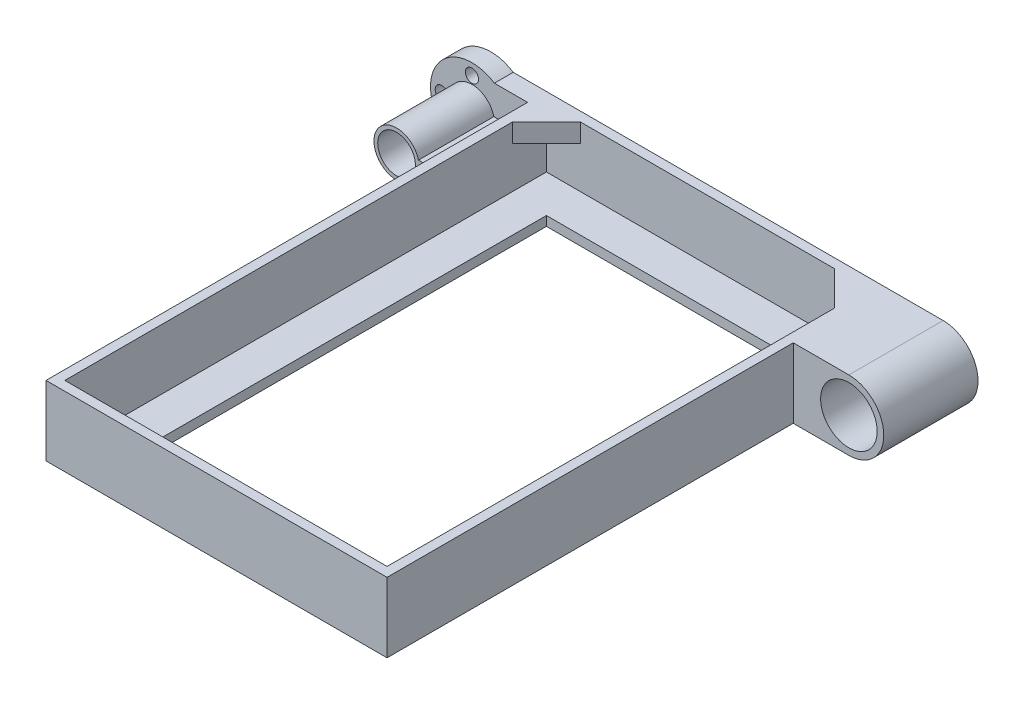
ISO-10303-21;
HEADER;
FILE_DESCRIPTION(('STEP AP214'),'2;1');
FILE_NAME('part.step','',(''),(''),'','','');
FILE_SCHEMA(('AUTOMOTIVE_DESIGN { 1 0 10303 214 1 1 1 1 }'));
ENDSEC;
DATA;
#1=APPLICATION_CONTEXT('core data for automotive mechanical design processes');
#2=APPLICATION_PROTOCOL_DEFINITION('international standard','automotive_design',2000,#1);
#3=PRODUCT_CONTEXT('',#1,'mechanical');
#4=PRODUCT('Part','Part','',(#3));
#5=PRODUCT_RELATED_PRODUCT_CATEGORY('part','',(#4));
#6=PRODUCT_DEFINITION_FORMATION('','',#4);
#7=PRODUCT_DEFINITION_CONTEXT('part definition',#1,'design');
#8=PRODUCT_DEFINITION('design','',#6,#7);
#9=PRODUCT_DEFINITION_SHAPE('','',#8);
#10=(LENGTH_UNIT() NAMED_UNIT(*) SI_UNIT(.MILLI.,.METRE.));
#11=(NAMED_UNIT(*) PLANE_ANGLE_UNIT() SI_UNIT($,.RADIAN.));
#12=(NAMED_UNIT(*) SI_UNIT($,.STERADIAN.) SOLID_ANGLE_UNIT());
#13=UNCERTAINTY_MEASURE_WITH_UNIT(LENGTH_MEASURE(1.E-05),#10,'distance_accuracy_value','');
#14=(GEOMETRIC_REPRESENTATION_CONTEXT(3) GLOBAL_UNCERTAINTY_ASSIGNED_CONTEXT((#13)) GLOBAL_UNIT_ASSIGNED_CONTEXT((#10,
#11,#12)) REPRESENTATION_CONTEXT('',''));
#15=CARTESIAN_POINT('',(0.,0.,0.));
#16=DIRECTION('',(0.,0.,1.));
#17=DIRECTION('',(1.,0.,0.));
#18=AXIS2_PLACEMENT_3D('',#15,#16,#17);
#19=CARTESIAN_POINT('',(45.24,16.,66.38));
#20=DIRECTION('',(-1.,0.,0.));
#21=DIRECTION('',(0.,0.,1.));
#22=AXIS2_PLACEMENT_3D('',#19,#20,#21);
#23=PLANE('',#22);
#24=DIRECTION('',(0.,-1.,0.));
#25=VECTOR('',#24,1.);
#26=CARTESIAN_POINT('',(45.24,0.,-41.38));
#27=LINE('',#26,#25);
#28=CARTESIAN_POINT('',(45.24,16.,-41.38));
#29=VERTEX_POINT('',#28);
#30=CARTESIAN_POINT('',(45.24,-2.5,-41.38));
#31=VERTEX_POINT('',#30);
#32=EDGE_CURVE('E400',#29,#31,#27,.T.);
#33=ORIENTED_EDGE('',*,*,#32,.F.);
#34=DIRECTION('',(0.,0.,-1.));
#35=VECTOR('',#34,1.);
#36=CARTESIAN_POINT('',(45.24,16.,66.38));
#37=LINE('',#36,#35);
#38=CARTESIAN_POINT('',(45.24,16.,66.38));
#39=VERTEX_POINT('',#38);
#40=EDGE_CURVE('E475',#39,#29,#37,.T.);
#41=ORIENTED_EDGE('',*,*,#40,.F.);
#42=DIRECTION('',(0.,-1.,0.));
#43=VECTOR('',#42,1.);
#44=CARTESIAN_POINT('',(45.24,16.,66.38));
#45=LINE('',#44,#43);
#46=CARTESIAN_POINT('',(45.24,-2.5,66.38));
#47=VERTEX_POINT('',#46);
#48=EDGE_CURVE('E488',#39,#47,#45,.T.);
#49=ORIENTED_EDGE('',*,*,#48,.T.);
#50=DIRECTION('',(0.,0.,1.));
#51=VECTOR('',#50,1.);
#52=CARTESIAN_POINT('',(45.24,-2.5,66.38));
#53=LINE('',#52,#51);
#54=EDGE_CURVE('E415',#31,#47,#53,.T.);
#55=ORIENTED_EDGE('',*,*,#54,.F.);
#56=EDGE_LOOP('',(#33,#41,#49,#55));
#57=FACE_BOUND('',#56,.T.);
#58=ADVANCED_FACE('F42',(#57),#23,.F.);
#59=CARTESIAN_POINT('',(0.,16.,0.));
#60=DIRECTION('',(0.,1.,0.));
#61=DIRECTION('',(0.,0.,1.));
#62=AXIS2_PLACEMENT_3D('',#59,#60,#61);
#63=PLANE('',#62);
#64=DIRECTION('',(-1.,0.,0.));
#65=VECTOR('',#64,1.);
#66=CARTESIAN_POINT('',(-45.24,16.,-61.38));
#67=LINE('',#66,#65);
#68=CARTESIAN_POINT('',(-45.24,16.,-61.38));
#69=VERTEX_POINT('',#68);
#70=CARTESIAN_POINT('',(-54.0470595501047,16.,-61.38));
#71=VERTEX_POINT('',#70);
#72=EDGE_CURVE('E334',#69,#71,#67,.T.);
#73=ORIENTED_EDGE('',*,*,#72,.F.);
#74=DIRECTION('',(0.,0.,1.));
#75=VECTOR('',#74,1.);
#76=CARTESIAN_POINT('',(-45.24,16.,66.38));
#77=LINE('',#76,#75);
#78=CARTESIAN_POINT('',(-45.24,16.,66.38));
#79=VERTEX_POINT('',#78);
#80=EDGE_CURVE('E482',#69,#79,#77,.T.);
#81=ORIENTED_EDGE('',*,*,#80,.T.);
#82=DIRECTION('',(1.,0.,0.));
#83=VECTOR('',#82,1.);
#84=CARTESIAN_POINT('',(-45.24,16.,66.38));
#85=LINE('',#84,#83);
#86=EDGE_CURVE('E471',#79,#39,#85,.T.);
#87=ORIENTED_EDGE('',*,*,#86,.T.);
#88=ORIENTED_EDGE('',*,*,#40,.T.);
#89=DIRECTION('',(1.,0.,0.));
#90=VECTOR('',#89,1.);
#91=CARTESIAN_POINT('',(0.,16.,-41.38));
#92=LINE('',#91,#90);
#93=CARTESIAN_POINT('',(60.,16.,-41.38));
#94=VERTEX_POINT('',#93);
#95=EDGE_CURVE('E388',#29,#94,#92,.T.);
#96=ORIENTED_EDGE('',*,*,#95,.T.);
#97=DIRECTION('',(0.,0.,-1.));
#98=VECTOR('',#97,1.);
#99=CARTESIAN_POINT('',(60.,16.,-41.38));
#100=LINE('',#99,#98);
#101=CARTESIAN_POINT('',(60.,16.,-66.38));
#102=VERTEX_POINT('',#101);
#103=EDGE_CURVE('E404',#94,#102,#100,.T.);
#104=ORIENTED_EDGE('',*,*,#103,.T.);
#105=DIRECTION('',(-1.,0.,0.));
#106=VECTOR('',#105,1.);
#107=CARTESIAN_POINT('',(-45.24,16.,-66.38));
#108=LINE('',#107,#106);
#109=CARTESIAN_POINT('',(-54.0470595501047,16.,-66.38));
#110=VERTEX_POINT('',#109);
#111=EDGE_CURVE('E479',#102,#110,#108,.T.);
#112=ORIENTED_EDGE('',*,*,#111,.T.);
#113=DIRECTION('',(0.,0.,-1.));
#114=VECTOR('',#113,1.);
#115=CARTESIAN_POINT('',(-54.0470595501047,16.,-61.38));
#116=LINE('',#115,#114);
#117=EDGE_CURVE('E364',#71,#110,#116,.T.);
#118=ORIENTED_EDGE('',*,*,#117,.F.);
#119=EDGE_LOOP('',(#73,#81,#87,#88,#96,#104,#112,#118));
#120=FACE_BOUND('',#119,.T.);
#121=DIRECTION('',(-1.,0.,0.));
#122=VECTOR('',#121,1.);
#123=CARTESIAN_POINT('',(-42.74,16.,-63.88));
#124=LINE('',#123,#122);
#125=CARTESIAN_POINT('',(33.74,16.,-63.88));
#126=VERTEX_POINT('',#125);
#127=CARTESIAN_POINT('',(-33.74,16.,-63.88));
#128=VERTEX_POINT('',#127);
#129=EDGE_CURVE('E435',#126,#128,#124,.T.);
#130=ORIENTED_EDGE('',*,*,#129,.F.);
#131=DIRECTION('',(0.707106781186547,0.,0.707106781186547));
#132=VECTOR('',#131,1.);
#133=CARTESIAN_POINT('',(33.74,16.,-63.88));
#134=LINE('',#133,#132);
#135=CARTESIAN_POINT('',(42.74,16.,-54.88));
#136=VERTEX_POINT('',#135);
#137=EDGE_CURVE('E259',#126,#136,#134,.T.);
#138=ORIENTED_EDGE('',*,*,#137,.T.);
#139=DIRECTION('',(0.,0.,-1.));
#140=VECTOR('',#139,1.);
#141=CARTESIAN_POINT('',(42.74,16.,63.88));
#142=LINE('',#141,#140);
#143=CARTESIAN_POINT('',(42.74,16.,63.88));
#144=VERTEX_POINT('',#143);
#145=EDGE_CURVE('E432',#144,#136,#142,.T.);
#146=ORIENTED_EDGE('',*,*,#145,.F.);
#147=DIRECTION('',(1.,0.,0.));
#148=VECTOR('',#147,1.);
#149=CARTESIAN_POINT('',(-42.74,16.,63.88));
#150=LINE('',#149,#148);
#151=CARTESIAN_POINT('',(-42.74,16.,63.88));
#152=VERTEX_POINT('',#151);
#153=EDGE_CURVE('E442',#152,#144,#150,.T.);
#154=ORIENTED_EDGE('',*,*,#153,.F.);
#155=DIRECTION('',(0.,0.,1.));
#156=VECTOR('',#155,1.);
#157=CARTESIAN_POINT('',(-42.74,16.,63.88));
#158=LINE('',#157,#156);
#159=CARTESIAN_POINT('',(-42.74,16.,-54.88));
#160=VERTEX_POINT('',#159);
#161=EDGE_CURVE('E439',#160,#152,#158,.T.);
#162=ORIENTED_EDGE('',*,*,#161,.F.);
#163=DIRECTION('',(0.707106781186547,0.,-0.707106781186547));
#164=VECTOR('',#163,1.);
#165=CARTESIAN_POINT('',(-42.74,16.,-54.88));
#166=LINE('',#165,#164);
#167=EDGE_CURVE('E235',#160,#128,#166,.T.);
#168=ORIENTED_EDGE('',*,*,#167,.T.);
#169=EDGE_LOOP('',(#130,#138,#146,#154,#162,#168));
#170=FACE_BOUND('',#169,.T.);
#171=ADVANCED_FACE('F517',(#120,#170),#63,.T.);
#172=CARTESIAN_POINT('',(-45.24,16.,66.38));
#173=DIRECTION('',(0.,0.,-1.));
#174=DIRECTION('',(-1.,0.,0.));
#175=AXIS2_PLACEMENT_3D('',#172,#173,#174);
#176=PLANE('',#175);
#177=DIRECTION('',(0.,-1.,0.));
#178=VECTOR('',#177,1.);
#179=CARTESIAN_POINT('',(-45.24,16.,66.38));
#180=LINE('',#179,#178);
#181=CARTESIAN_POINT('',(-45.24,-2.5,66.38));
#182=VERTEX_POINT('',#181);
#183=EDGE_CURVE('E485',#79,#182,#180,.T.);
#184=ORIENTED_EDGE('',*,*,#183,.T.);
#185=DIRECTION('',(-1.,0.,0.));
#186=VECTOR('',#185,1.);
#187=CARTESIAN_POINT('',(-45.24,-2.5,66.38));
#188=LINE('',#187,#186);
#189=EDGE_CURVE('E421',#47,#182,#188,.T.);
#190=ORIENTED_EDGE('',*,*,#189,.F.);
#191=ORIENTED_EDGE('',*,*,#48,.F.);
#192=ORIENTED_EDGE('',*,*,#86,.F.);
#193=EDGE_LOOP('',(#184,#190,#191,#192));
#194=FACE_BOUND('',#193,.T.);
#195=ADVANCED_FACE('F44',(#194),#176,.F.);
#196=CARTESIAN_POINT('',(-45.24,16.,-66.38));
#197=DIRECTION('',(0.,0.,1.));
#198=DIRECTION('',(1.,0.,0.));
#199=AXIS2_PLACEMENT_3D('',#196,#197,#198);
#200=PLANE('',#199);
#201=CARTESIAN_POINT('',(-60.,14.75,-66.38));
#202=DIRECTION('',(0.,0.,-1.));
#203=DIRECTION('',(-1.,0.,0.));
#204=AXIS2_PLACEMENT_3D('',#201,#202,#203);
#205=CIRCLE('',#204,1.75);
#206=CARTESIAN_POINT('',(-61.75,14.75,-66.38));
#207=VERTEX_POINT('',#206);
#208=EDGE_CURVE('E285',#207,#207,#205,.T.);
#209=ORIENTED_EDGE('',*,*,#208,.F.);
#210=EDGE_LOOP('',(#209));
#211=FACE_BOUND('',#210,.T.);
#212=CARTESIAN_POINT('',(-68.,6.75,-66.38));
#213=DIRECTION('',(0.,0.,-1.));
#214=DIRECTION('',(-1.,0.,0.));
#215=AXIS2_PLACEMENT_3D('',#212,#213,#214);
#216=CIRCLE('',#215,1.75);
#217=CARTESIAN_POINT('',(-69.75,6.75,-66.38));
#218=VERTEX_POINT('',#217);
#219=EDGE_CURVE('E295',#218,#218,#216,.T.);
#220=ORIENTED_EDGE('',*,*,#219,.F.);
#221=EDGE_LOOP('',(#220));
#222=FACE_BOUND('',#221,.T.);
#223=CARTESIAN_POINT('',(-60.,-1.25000000000001,-66.38));
#224=DIRECTION('',(0.,0.,-1.));
#225=DIRECTION('',(-1.,0.,0.));
#226=AXIS2_PLACEMENT_3D('',#223,#224,#225);
#227=CIRCLE('',#226,1.75);
#228=CARTESIAN_POINT('',(-61.75,-1.25000000000001,-66.38));
#229=VERTEX_POINT('',#228);
#230=EDGE_CURVE('E281',#229,#229,#227,.T.);
#231=ORIENTED_EDGE('',*,*,#230,.F.);
#232=EDGE_LOOP('',(#231));
#233=FACE_BOUND('',#232,.T.);
#234=DIRECTION('',(1.,0.,0.));
#235=VECTOR('',#234,1.);
#236=CARTESIAN_POINT('',(45.24,-2.5,-66.38));
#237=LINE('',#236,#235);
#238=CARTESIAN_POINT('',(-54.0470595501047,-2.5,-66.38));
#239=VERTEX_POINT('',#238);
#240=CARTESIAN_POINT('',(60.,-2.5,-66.38));
#241=VERTEX_POINT('',#240);
#242=EDGE_CURVE('E428',#239,#241,#237,.T.);
#243=ORIENTED_EDGE('',*,*,#242,.F.);
#244=CARTESIAN_POINT('',(-60.,6.75,-66.38));
#245=DIRECTION('',(0.,0.,-1.));
#246=DIRECTION('',(-1.,0.,0.));
#247=AXIS2_PLACEMENT_3D('',#244,#245,#246);
#248=CIRCLE('',#247,11.);
#249=EDGE_CURVE('E359',#239,#110,#248,.T.);
#250=ORIENTED_EDGE('',*,*,#249,.T.);
#251=ORIENTED_EDGE('',*,*,#111,.F.);
#252=CARTESIAN_POINT('',(60.,6.75,-66.38));
#253=DIRECTION('',(0.,0.,-1.));
#254=DIRECTION('',(-1.,0.,0.));
#255=AXIS2_PLACEMENT_3D('',#252,#253,#254);
#256=CIRCLE('',#255,9.25);
#257=EDGE_CURVE('E389',#102,#241,#256,.T.);
#258=ORIENTED_EDGE('',*,*,#257,.T.);
#259=EDGE_LOOP('',(#243,#250,#251,#258));
#260=FACE_BOUND('',#259,.T.);
#261=CARTESIAN_POINT('',(60.,6.75,-66.38));
#262=DIRECTION('',(0.,0.,-1.));
#263=DIRECTION('',(-1.,0.,0.));
#264=AXIS2_PLACEMENT_3D('',#261,#262,#263);
#265=CIRCLE('',#264,7.5);
#266=CARTESIAN_POINT('',(52.5,6.75,-66.38));
#267=VERTEX_POINT('',#266);
#268=EDGE_CURVE('E383',#267,#267,#265,.T.);
#269=ORIENTED_EDGE('',*,*,#268,.F.);
#270=EDGE_LOOP('',(#269));
#271=FACE_BOUND('',#270,.T.);
#272=CARTESIAN_POINT('',(-60.,6.75,-66.38));
#273=DIRECTION('',(0.,0.,-1.));
#274=DIRECTION('',(-1.,0.,0.));
#275=AXIS2_PLACEMENT_3D('',#272,#273,#274);
#276=CIRCLE('',#275,5.);
#277=CARTESIAN_POINT('',(-65.,6.75,-66.38));
#278=VERTEX_POINT('',#277);
#279=EDGE_CURVE('E371',#278,#278,#276,.T.);
#280=ORIENTED_EDGE('',*,*,#279,.F.);
#281=EDGE_LOOP('',(#280));
#282=FACE_BOUND('',#281,.T.);
#283=ADVANCED_FACE('F526',(#211,#222,#233,#260,#271,#282),#200,.F.);
#284=CARTESIAN_POINT('',(-45.24,16.,66.38));
#285=DIRECTION('',(1.,0.,0.));
#286=DIRECTION('',(0.,0.,-1.));
#287=AXIS2_PLACEMENT_3D('',#284,#285,#286);
#288=PLANE('',#287);
#289=ORIENTED_EDGE('',*,*,#80,.F.);
#290=DIRECTION('',(0.,1.,0.));
#291=VECTOR('',#290,1.);
#292=CARTESIAN_POINT('',(-45.24,8.25,-61.38));
#293=LINE('',#292,#291);
#294=CARTESIAN_POINT('',(-45.24,8.25,-61.38));
#295=VERTEX_POINT('',#294);
#296=EDGE_CURVE('E337',#295,#69,#293,.T.);
#297=ORIENTED_EDGE('',*,*,#296,.F.);
#298=DIRECTION('',(0.,0.,1.));
#299=VECTOR('',#298,1.);
#300=CARTESIAN_POINT('',(-45.24,8.25,-91.6905608658105));
#301=LINE('',#300,#299);
#302=CARTESIAN_POINT('',(-45.24,8.25,-41.38));
#303=VERTEX_POINT('',#302);
#304=EDGE_CURVE('E341',#295,#303,#301,.T.);
#305=ORIENTED_EDGE('',*,*,#304,.T.);
#306=DIRECTION('',(0.,-1.,0.));
#307=VECTOR('',#306,1.);
#308=CARTESIAN_POINT('',(-45.24,0.,-41.38));
#309=LINE('',#308,#307);
#310=CARTESIAN_POINT('',(-45.24,5.25,-41.38));
#311=VERTEX_POINT('',#310);
#312=EDGE_CURVE('E379',#303,#311,#309,.T.);
#313=ORIENTED_EDGE('',*,*,#312,.T.);
#314=DIRECTION('',(0.,0.,1.));
#315=VECTOR('',#314,1.);
#316=CARTESIAN_POINT('',(-45.24,5.25,-91.6905608658105));
#317=LINE('',#316,#315);
#318=CARTESIAN_POINT('',(-45.24,5.25,-61.38));
#319=VERTEX_POINT('',#318);
#320=EDGE_CURVE('E329',#319,#311,#317,.T.);
#321=ORIENTED_EDGE('',*,*,#320,.F.);
#322=DIRECTION('',(0.,1.,0.));
#323=VECTOR('',#322,1.);
#324=CARTESIAN_POINT('',(-45.24,5.25,-61.38));
#325=LINE('',#324,#323);
#326=CARTESIAN_POINT('',(-45.24,-2.5,-61.38));
#327=VERTEX_POINT('',#326);
#328=EDGE_CURVE('E325',#327,#319,#325,.T.);
#329=ORIENTED_EDGE('',*,*,#328,.F.);
#330=DIRECTION('',(0.,0.,-1.));
#331=VECTOR('',#330,1.);
#332=CARTESIAN_POINT('',(-45.24,-2.5,-66.38));
#333=LINE('',#332,#331);
#334=EDGE_CURVE('E425',#182,#327,#333,.T.);
#335=ORIENTED_EDGE('',*,*,#334,.F.);
#336=ORIENTED_EDGE('',*,*,#183,.F.);
#337=EDGE_LOOP('',(#289,#297,#305,#313,#321,#329,#335,#336));
#338=FACE_BOUND('',#337,.T.);
#339=ADVANCED_FACE('F529',(#338),#288,.F.);
#340=CARTESIAN_POINT('',(42.74,16.,63.88));
#341=DIRECTION('',(-1.,0.,0.));
#342=DIRECTION('',(0.,0.,1.));
#343=AXIS2_PLACEMENT_3D('',#340,#341,#342);
#344=PLANE('',#343);
#345=DIRECTION('',(0.,1.,0.));
#346=VECTOR('',#345,1.);
#347=CARTESIAN_POINT('',(42.74,11.,-54.88));
#348=LINE('',#347,#346);
#349=CARTESIAN_POINT('',(42.74,11.,-54.88));
#350=VERTEX_POINT('',#349);
#351=EDGE_CURVE('E277',#350,#136,#348,.T.);
#352=ORIENTED_EDGE('',*,*,#351,.F.);
#353=DIRECTION('',(0.,0.,-1.));
#354=VECTOR('',#353,1.);
#355=CARTESIAN_POINT('',(42.74,11.,-63.88));
#356=LINE('',#355,#354);
#357=CARTESIAN_POINT('',(42.74,11.,-63.88));
#358=VERTEX_POINT('',#357);
#359=EDGE_CURVE('E270',#350,#358,#356,.T.);
#360=ORIENTED_EDGE('',*,*,#359,.T.);
#361=DIRECTION('',(0.,-1.,0.));
#362=VECTOR('',#361,1.);
#363=CARTESIAN_POINT('',(42.74,16.,-63.88));
#364=LINE('',#363,#362);
#365=CARTESIAN_POINT('',(42.74,0.,-63.88));
#366=VERTEX_POINT('',#365);
#367=EDGE_CURVE('E468',#358,#366,#364,.T.);
#368=ORIENTED_EDGE('',*,*,#367,.T.);
#369=DIRECTION('',(0.,0.,-1.));
#370=VECTOR('',#369,1.);
#371=CARTESIAN_POINT('',(42.74,0.,63.88));
#372=LINE('',#371,#370);
#373=CARTESIAN_POINT('',(42.74,0.,63.88));
#374=VERTEX_POINT('',#373);
#375=EDGE_CURVE('E431',#374,#366,#372,.T.);
#376=ORIENTED_EDGE('',*,*,#375,.F.);
#377=DIRECTION('',(0.,-1.,0.));
#378=VECTOR('',#377,1.);
#379=CARTESIAN_POINT('',(42.74,16.,63.88));
#380=LINE('',#379,#378);
#381=EDGE_CURVE('E445',#144,#374,#380,.T.);
#382=ORIENTED_EDGE('',*,*,#381,.F.);
#383=ORIENTED_EDGE('',*,*,#145,.T.);
#384=EDGE_LOOP('',(#352,#360,#368,#376,#382,#383));
#385=FACE_BOUND('',#384,.T.);
#386=ADVANCED_FACE('F532',(#385),#344,.T.);
#387=CARTESIAN_POINT('',(-42.74,16.,-63.88));
#388=DIRECTION('',(0.,0.,1.));
#389=DIRECTION('',(1.,0.,0.));
#390=AXIS2_PLACEMENT_3D('',#387,#388,#389);
#391=PLANE('',#390);
#392=DIRECTION('',(0.,1.,0.));
#393=VECTOR('',#392,1.);
#394=CARTESIAN_POINT('',(-33.74,11.,-63.88));
#395=LINE('',#394,#393);
#396=CARTESIAN_POINT('',(-33.74,11.,-63.88));
#397=VERTEX_POINT('',#396);
#398=EDGE_CURVE('E255',#397,#128,#395,.T.);
#399=ORIENTED_EDGE('',*,*,#398,.F.);
#400=DIRECTION('',(-1.,0.,0.));
#401=VECTOR('',#400,1.);
#402=CARTESIAN_POINT('',(-33.74,11.,-63.88));
#403=LINE('',#402,#401);
#404=CARTESIAN_POINT('',(-42.74,11.,-63.88));
#405=VERTEX_POINT('',#404);
#406=EDGE_CURVE('E248',#397,#405,#403,.T.);
#407=ORIENTED_EDGE('',*,*,#406,.T.);
#408=DIRECTION('',(0.,-1.,0.));
#409=VECTOR('',#408,1.);
#410=CARTESIAN_POINT('',(-42.74,16.,-63.88));
#411=LINE('',#410,#409);
#412=CARTESIAN_POINT('',(-42.74,0.,-63.88));
#413=VERTEX_POINT('',#412);
#414=EDGE_CURVE('E465',#405,#413,#411,.T.);
#415=ORIENTED_EDGE('',*,*,#414,.T.);
#416=DIRECTION('',(-1.,0.,0.));
#417=VECTOR('',#416,1.);
#418=CARTESIAN_POINT('',(-42.74,0.,-63.88));
#419=LINE('',#418,#417);
#420=EDGE_CURVE('E449',#366,#413,#419,.T.);
#421=ORIENTED_EDGE('',*,*,#420,.F.);
#422=ORIENTED_EDGE('',*,*,#367,.F.);
#423=DIRECTION('',(-1.,0.,0.));
#424=VECTOR('',#423,1.);
#425=CARTESIAN_POINT('',(33.74,11.,-63.88));
#426=LINE('',#425,#424);
#427=CARTESIAN_POINT('',(33.74,11.,-63.88));
#428=VERTEX_POINT('',#427);
#429=EDGE_CURVE('E263',#358,#428,#426,.T.);
#430=ORIENTED_EDGE('',*,*,#429,.T.);
#431=DIRECTION('',(0.,1.,0.));
#432=VECTOR('',#431,1.);
#433=CARTESIAN_POINT('',(33.74,11.,-63.88));
#434=LINE('',#433,#432);
#435=EDGE_CURVE('E273',#428,#126,#434,.T.);
#436=ORIENTED_EDGE('',*,*,#435,.T.);
#437=ORIENTED_EDGE('',*,*,#129,.T.);
#438=EDGE_LOOP('',(#399,#407,#415,#421,#422,#430,#436,#437));
#439=FACE_BOUND('',#438,.T.);
#440=ADVANCED_FACE('F537',(#439),#391,.T.);
#441=CARTESIAN_POINT('',(-42.74,16.,63.88));
#442=DIRECTION('',(1.,0.,0.));
#443=DIRECTION('',(0.,0.,-1.));
#444=AXIS2_PLACEMENT_3D('',#441,#442,#443);
#445=PLANE('',#444);
#446=DIRECTION('',(0.,1.,0.));
#447=VECTOR('',#446,1.);
#448=CARTESIAN_POINT('',(-42.74,11.,-54.88));
#449=LINE('',#448,#447);
#450=CARTESIAN_POINT('',(-42.74,11.,-54.88));
#451=VERTEX_POINT('',#450);
#452=EDGE_CURVE('E251',#451,#160,#449,.T.);
#453=ORIENTED_EDGE('',*,*,#452,.T.);
#454=ORIENTED_EDGE('',*,*,#161,.T.);
#455=DIRECTION('',(0.,-1.,0.));
#456=VECTOR('',#455,1.);
#457=CARTESIAN_POINT('',(-42.74,16.,63.88));
#458=LINE('',#457,#456);
#459=CARTESIAN_POINT('',(-42.74,0.,63.88));
#460=VERTEX_POINT('',#459);
#461=EDGE_CURVE('E462',#152,#460,#458,.T.);
#462=ORIENTED_EDGE('',*,*,#461,.T.);
#463=DIRECTION('',(0.,0.,1.));
#464=VECTOR('',#463,1.);
#465=CARTESIAN_POINT('',(-42.74,0.,63.88));
#466=LINE('',#465,#464);
#467=EDGE_CURVE('E453',#413,#460,#466,.T.);
#468=ORIENTED_EDGE('',*,*,#467,.F.);
#469=ORIENTED_EDGE('',*,*,#414,.F.);
#470=DIRECTION('',(0.,0.,1.));
#471=VECTOR('',#470,1.);
#472=CARTESIAN_POINT('',(-42.74,11.,-63.88));
#473=LINE('',#472,#471);
#474=EDGE_CURVE('E241',#405,#451,#473,.T.);
#475=ORIENTED_EDGE('',*,*,#474,.T.);
#476=EDGE_LOOP('',(#453,#454,#462,#468,#469,#475));
#477=FACE_BOUND('',#476,.T.);
#478=ADVANCED_FACE('F541',(#477),#445,.T.);
#479=CARTESIAN_POINT('',(-42.74,16.,63.88));
#480=DIRECTION('',(0.,0.,-1.));
#481=DIRECTION('',(-1.,0.,0.));
#482=AXIS2_PLACEMENT_3D('',#479,#480,#481);
#483=PLANE('',#482);
#484=DIRECTION('',(1.,0.,0.));
#485=VECTOR('',#484,1.);
#486=CARTESIAN_POINT('',(-42.74,0.,63.88));
#487=LINE('',#486,#485);
#488=EDGE_CURVE('E436',#460,#374,#487,.T.);
#489=ORIENTED_EDGE('',*,*,#488,.F.);
#490=ORIENTED_EDGE('',*,*,#461,.F.);
#491=ORIENTED_EDGE('',*,*,#153,.T.);
#492=ORIENTED_EDGE('',*,*,#381,.T.);
#493=EDGE_LOOP('',(#489,#490,#491,#492));
#494=FACE_BOUND('',#493,.T.);
#495=ADVANCED_FACE('F545',(#494),#483,.T.);
#496=CARTESIAN_POINT('',(0.,0.,0.));
#497=DIRECTION('',(0.,1.,0.));
#498=DIRECTION('',(0.,0.,1.));
#499=AXIS2_PLACEMENT_3D('',#496,#497,#498);
#500=PLANE('',#499);
#501=DIRECTION('',(0.,0.,-1.));
#502=VECTOR('',#501,1.);
#503=CARTESIAN_POINT('',(32.74,0.,53.88));
#504=LINE('',#503,#502);
#505=CARTESIAN_POINT('',(32.74,0.,53.88));
#506=VERTEX_POINT('',#505);
#507=CARTESIAN_POINT('',(32.74,0.,-53.88));
#508=VERTEX_POINT('',#507);
#509=EDGE_CURVE('E215',#506,#508,#504,.T.);
#510=ORIENTED_EDGE('',*,*,#509,.F.);
#511=DIRECTION('',(1.,0.,0.));
#512=VECTOR('',#511,1.);
#513=CARTESIAN_POINT('',(-32.74,0.,53.88));
#514=LINE('',#513,#512);
#515=CARTESIAN_POINT('',(-32.74,0.,53.88));
#516=VERTEX_POINT('',#515);
#517=EDGE_CURVE('E212',#516,#506,#514,.T.);
#518=ORIENTED_EDGE('',*,*,#517,.F.);
#519=DIRECTION('',(0.,0.,1.));
#520=VECTOR('',#519,1.);
#521=CARTESIAN_POINT('',(-32.74,0.,-53.88));
#522=LINE('',#521,#520);
#523=CARTESIAN_POINT('',(-32.74,0.,-53.88));
#524=VERTEX_POINT('',#523);
#525=EDGE_CURVE('E58',#524,#516,#522,.T.);
#526=ORIENTED_EDGE('',*,*,#525,.F.);
#527=DIRECTION('',(-1.,0.,0.));
#528=VECTOR('',#527,1.);
#529=CARTESIAN_POINT('',(32.74,0.,-53.88));
#530=LINE('',#529,#528);
#531=EDGE_CURVE('E207',#508,#524,#530,.T.);
#532=ORIENTED_EDGE('',*,*,#531,.F.);
#533=EDGE_LOOP('',(#510,#518,#526,#532));
#534=FACE_BOUND('',#533,.T.);
#535=ORIENTED_EDGE('',*,*,#488,.T.);
#536=ORIENTED_EDGE('',*,*,#375,.T.);
#537=ORIENTED_EDGE('',*,*,#420,.T.);
#538=ORIENTED_EDGE('',*,*,#467,.T.);
#539=EDGE_LOOP('',(#535,#536,#537,#538));
#540=FACE_BOUND('',#539,.T.);
#541=ADVANCED_FACE('F224',(#534,#540),#500,.T.);
#542=CARTESIAN_POINT('',(0.,-2.5,0.));
#543=DIRECTION('',(0.,1.,0.));
#544=DIRECTION('',(0.,0.,1.));
#545=AXIS2_PLACEMENT_3D('',#542,#543,#544);
#546=PLANE('',#545);
#547=DIRECTION('',(1.,0.,0.));
#548=VECTOR('',#547,1.);
#549=CARTESIAN_POINT('',(0.,-2.5,53.88));
#550=LINE('',#549,#548);
#551=CARTESIAN_POINT('',(-32.74,-2.5,53.88));
#552=VERTEX_POINT('',#551);
#553=CARTESIAN_POINT('',(32.74,-2.5,53.88));
#554=VERTEX_POINT('',#553);
#555=EDGE_CURVE('E51',#552,#554,#550,.T.);
#556=ORIENTED_EDGE('',*,*,#555,.T.);
#557=DIRECTION('',(0.,0.,-1.));
#558=VECTOR('',#557,1.);
#559=CARTESIAN_POINT('',(32.74,-2.5,0.));
#560=LINE('',#559,#558);
#561=CARTESIAN_POINT('',(32.74,-2.5,-53.88));
#562=VERTEX_POINT('',#561);
#563=EDGE_CURVE('E11',#554,#562,#560,.T.);
#564=ORIENTED_EDGE('',*,*,#563,.T.);
#565=DIRECTION('',(-1.,0.,0.));
#566=VECTOR('',#565,1.);
#567=CARTESIAN_POINT('',(0.,-2.5,-53.88));
#568=LINE('',#567,#566);
#569=CARTESIAN_POINT('',(-32.74,-2.5,-53.88));
#570=VERTEX_POINT('',#569);
#571=EDGE_CURVE('E209',#562,#570,#568,.T.);
#572=ORIENTED_EDGE('',*,*,#571,.T.);
#573=DIRECTION('',(0.,0.,1.));
#574=VECTOR('',#573,1.);
#575=CARTESIAN_POINT('',(-32.74,-2.5,0.));
#576=LINE('',#575,#574);
#577=EDGE_CURVE('E497',#570,#552,#576,.T.);
#578=ORIENTED_EDGE('',*,*,#577,.T.);
#579=EDGE_LOOP('',(#556,#564,#572,#578));
#580=FACE_BOUND('',#579,.T.);
#581=ORIENTED_EDGE('',*,*,#334,.T.);
#582=DIRECTION('',(1.,0.,0.));
#583=VECTOR('',#582,1.);
#584=CARTESIAN_POINT('',(-45.24,-2.5,-61.38));
#585=LINE('',#584,#583);
#586=CARTESIAN_POINT('',(-54.0470595501047,-2.5,-61.38));
#587=VERTEX_POINT('',#586);
#588=EDGE_CURVE('E330',#587,#327,#585,.T.);
#589=ORIENTED_EDGE('',*,*,#588,.F.);
#590=DIRECTION('',(0.,0.,-1.));
#591=VECTOR('',#590,1.);
#592=CARTESIAN_POINT('',(-54.0470595501047,-2.5,-61.38));
#593=LINE('',#592,#591);
#594=EDGE_CURVE('E492',#587,#239,#593,.T.);
#595=ORIENTED_EDGE('',*,*,#594,.T.);
#596=ORIENTED_EDGE('',*,*,#242,.T.);
#597=DIRECTION('',(0.,0.,-1.));
#598=VECTOR('',#597,1.);
#599=CARTESIAN_POINT('',(60.,-2.5,-41.38));
#600=LINE('',#599,#598);
#601=CARTESIAN_POINT('',(60.,-2.5,-41.38));
#602=VERTEX_POINT('',#601);
#603=EDGE_CURVE('E411',#602,#241,#600,.T.);
#604=ORIENTED_EDGE('',*,*,#603,.F.);
#605=DIRECTION('',(1.,0.,0.));
#606=VECTOR('',#605,1.);
#607=CARTESIAN_POINT('',(0.,-2.49999999999999,-41.38));
#608=LINE('',#607,#606);
#609=EDGE_CURVE('E397',#31,#602,#608,.T.);
#610=ORIENTED_EDGE('',*,*,#609,.F.);
#611=ORIENTED_EDGE('',*,*,#54,.T.);
#612=ORIENTED_EDGE('',*,*,#189,.T.);
#613=EDGE_LOOP('',(#581,#589,#595,#596,#604,#610,#611,#612));
#614=FACE_BOUND('',#613,.T.);
#615=ADVANCED_FACE('F503',(#580,#614),#546,.F.);
#616=CARTESIAN_POINT('',(60.,6.75,-41.38));
#617=DIRECTION('',(0.,0.,-1.));
#618=DIRECTION('',(-1.,0.,0.));
#619=AXIS2_PLACEMENT_3D('',#616,#617,#618);
#620=CYLINDRICAL_SURFACE('',#619,7.5);
#621=CARTESIAN_POINT('',(60.,6.75,-41.38));
#622=DIRECTION('',(0.,0.,-1.));
#623=DIRECTION('',(-1.,0.,0.));
#624=AXIS2_PLACEMENT_3D('',#621,#622,#623);
#625=CIRCLE('',#624,7.5);
#626=CARTESIAN_POINT('',(52.5,6.75,-41.38));
#627=VERTEX_POINT('',#626);
#628=EDGE_CURVE('E384',#627,#627,#625,.T.);
#629=ORIENTED_EDGE('',*,*,#628,.F.);
#630=EDGE_LOOP('',(#629));
#631=FACE_BOUND('',#630,.T.);
#632=ORIENTED_EDGE('',*,*,#268,.T.);
#633=EDGE_LOOP('',(#632));
#634=FACE_BOUND('',#633,.T.);
#635=ADVANCED_FACE('F554',(#631,#634),#620,.F.);
#636=CARTESIAN_POINT('',(60.,6.75,-41.38));
#637=DIRECTION('',(0.,0.,-1.));
#638=DIRECTION('',(-1.,0.,0.));
#639=AXIS2_PLACEMENT_3D('',#636,#637,#638);
#640=CYLINDRICAL_SURFACE('',#639,9.25);
#641=ORIENTED_EDGE('',*,*,#257,.F.);
#642=ORIENTED_EDGE('',*,*,#103,.F.);
#643=CARTESIAN_POINT('',(60.,6.75,-41.38));
#644=DIRECTION('',(0.,0.,-1.));
#645=DIRECTION('',(-1.,0.,0.));
#646=AXIS2_PLACEMENT_3D('',#643,#644,#645);
#647=CIRCLE('',#646,9.25);
#648=EDGE_CURVE('E393',#94,#602,#647,.T.);
#649=ORIENTED_EDGE('',*,*,#648,.T.);
#650=ORIENTED_EDGE('',*,*,#603,.T.);
#651=EDGE_LOOP('',(#641,#642,#649,#650));
#652=FACE_BOUND('',#651,.T.);
#653=ADVANCED_FACE('F557',(#652),#640,.T.);
#654=CARTESIAN_POINT('',(0.,0.,-41.38));
#655=DIRECTION('',(0.,0.,-1.));
#656=DIRECTION('',(-1.,0.,0.));
#657=AXIS2_PLACEMENT_3D('',#654,#655,#656);
#658=PLANE('',#657);
#659=ORIENTED_EDGE('',*,*,#628,.T.);
#660=EDGE_LOOP('',(#659));
#661=FACE_BOUND('',#660,.T.);
#662=ORIENTED_EDGE('',*,*,#95,.F.);
#663=ORIENTED_EDGE('',*,*,#32,.T.);
#664=ORIENTED_EDGE('',*,*,#609,.T.);
#665=ORIENTED_EDGE('',*,*,#648,.F.);
#666=EDGE_LOOP('',(#662,#663,#664,#665));
#667=FACE_BOUND('',#666,.T.);
#668=ADVANCED_FACE('F561',(#661,#667),#658,.F.);
#669=CARTESIAN_POINT('',(0.,0.,-41.38));
#670=DIRECTION('',(0.,0.,-1.));
#671=DIRECTION('',(1.,0.,0.));
#672=AXIS2_PLACEMENT_3D('',#669,#670,#671);
#673=PLANE('',#672);
#674=CARTESIAN_POINT('',(-60.,6.75,-41.38));
#675=DIRECTION('',(0.,0.,-1.));
#676=DIRECTION('',(1.,0.,0.));
#677=AXIS2_PLACEMENT_3D('',#674,#675,#676);
#678=CIRCLE('',#677,6.);
#679=CARTESIAN_POINT('',(-54.1905249806889,5.25,-41.38));
#680=VERTEX_POINT('',#679);
#681=CARTESIAN_POINT('',(-54.1905249806889,8.25,-41.38));
#682=VERTEX_POINT('',#681);
#683=EDGE_CURVE('E314',#680,#682,#678,.T.);
#684=ORIENTED_EDGE('',*,*,#683,.F.);
#685=DIRECTION('',(-1.,0.,0.));
#686=VECTOR('',#685,1.);
#687=CARTESIAN_POINT('',(-45.24,5.25,-41.38));
#688=LINE('',#687,#686);
#689=EDGE_CURVE('E294',#311,#680,#688,.T.);
#690=ORIENTED_EDGE('',*,*,#689,.F.);
#691=ORIENTED_EDGE('',*,*,#312,.F.);
#692=DIRECTION('',(1.,0.,0.));
#693=VECTOR('',#692,1.);
#694=CARTESIAN_POINT('',(-45.24,8.25,-41.38));
#695=LINE('',#694,#693);
#696=EDGE_CURVE('E309',#682,#303,#695,.T.);
#697=ORIENTED_EDGE('',*,*,#696,.F.);
#698=EDGE_LOOP('',(#684,#690,#691,#697));
#699=FACE_BOUND('',#698,.T.);
#700=CARTESIAN_POINT('',(-60.,6.75,-41.38));
#701=DIRECTION('',(0.,0.,-1.));
#702=DIRECTION('',(-1.,0.,0.));
#703=AXIS2_PLACEMENT_3D('',#700,#701,#702);
#704=CIRCLE('',#703,5.);
#705=CARTESIAN_POINT('',(-65.,6.75,-41.38));
#706=VERTEX_POINT('',#705);
#707=EDGE_CURVE('E375',#706,#706,#704,.F.);
#708=ORIENTED_EDGE('',*,*,#707,.F.);
#709=EDGE_LOOP('',(#708));
#710=FACE_BOUND('',#709,.T.);
#711=ADVANCED_FACE('F565',(#699,#710),#673,.F.);
#712=CARTESIAN_POINT('',(-60.,6.75,-20.1667965644036));
#713=DIRECTION('',(0.,0.,-1.));
#714=DIRECTION('',(-1.,0.,0.));
#715=AXIS2_PLACEMENT_3D('',#712,#713,#714);
#716=CYLINDRICAL_SURFACE('',#715,5.);
#717=ORIENTED_EDGE('',*,*,#279,.T.);
#718=EDGE_LOOP('',(#717));
#719=FACE_BOUND('',#718,.T.);
#720=ORIENTED_EDGE('',*,*,#707,.T.);
#721=EDGE_LOOP('',(#720));
#722=FACE_BOUND('',#721,.T.);
#723=ADVANCED_FACE('F569',(#719,#722),#716,.F.);
#724=CARTESIAN_POINT('',(-60.,6.75,-61.38));
#725=DIRECTION('',(0.,0.,-1.));
#726=DIRECTION('',(-1.,0.,0.));
#727=AXIS2_PLACEMENT_3D('',#724,#725,#726);
#728=CYLINDRICAL_SURFACE('',#727,11.);
#729=CARTESIAN_POINT('',(-60.,6.75,-61.38));
#730=DIRECTION('',(0.,0.,-1.));
#731=DIRECTION('',(-1.,0.,0.));
#732=AXIS2_PLACEMENT_3D('',#729,#730,#731);
#733=CIRCLE('',#732,11.);
#734=EDGE_CURVE('E360',#587,#71,#733,.T.);
#735=ORIENTED_EDGE('',*,*,#734,.T.);
#736=ORIENTED_EDGE('',*,*,#117,.T.);
#737=ORIENTED_EDGE('',*,*,#249,.F.);
#738=ORIENTED_EDGE('',*,*,#594,.F.);
#739=EDGE_LOOP('',(#735,#736,#737,#738));
#740=FACE_BOUND('',#739,.T.);
#741=ADVANCED_FACE('F573',(#740),#728,.T.);
#742=CARTESIAN_POINT('',(-60.,6.75,-61.38));
#743=DIRECTION('',(0.,0.,-1.));
#744=DIRECTION('',(-1.,0.,0.));
#745=AXIS2_PLACEMENT_3D('',#742,#743,#744);
#746=PLANE('',#745);
#747=CARTESIAN_POINT('',(-60.,14.75,-61.38));
#748=DIRECTION('',(0.,0.,-1.));
#749=DIRECTION('',(-1.,0.,0.));
#750=AXIS2_PLACEMENT_3D('',#747,#748,#749);
#751=CIRCLE('',#750,1.75);
#752=CARTESIAN_POINT('',(-61.75,14.75,-61.38));
#753=VERTEX_POINT('',#752);
#754=EDGE_CURVE('E289',#753,#753,#751,.F.);
#755=ORIENTED_EDGE('',*,*,#754,.F.);
#756=EDGE_LOOP('',(#755));
#757=FACE_BOUND('',#756,.T.);
#758=CARTESIAN_POINT('',(-68.,6.75,-61.38));
#759=DIRECTION('',(0.,0.,-1.));
#760=DIRECTION('',(-1.,0.,0.));
#761=AXIS2_PLACEMENT_3D('',#758,#759,#760);
#762=CIRCLE('',#761,1.75);
#763=CARTESIAN_POINT('',(-69.75,6.75,-61.38));
#764=VERTEX_POINT('',#763);
#765=EDGE_CURVE('E290',#764,#764,#762,.F.);
#766=ORIENTED_EDGE('',*,*,#765,.F.);
#767=EDGE_LOOP('',(#766));
#768=FACE_BOUND('',#767,.T.);
#769=CARTESIAN_POINT('',(-60.,-1.25000000000001,-61.38));
#770=DIRECTION('',(0.,0.,-1.));
#771=DIRECTION('',(-1.,0.,0.));
#772=AXIS2_PLACEMENT_3D('',#769,#770,#771);
#773=CIRCLE('',#772,1.75);
#774=CARTESIAN_POINT('',(-61.75,-1.25000000000001,-61.38));
#775=VERTEX_POINT('',#774);
#776=EDGE_CURVE('E299',#775,#775,#773,.F.);
#777=ORIENTED_EDGE('',*,*,#776,.F.);
#778=EDGE_LOOP('',(#777));
#779=FACE_BOUND('',#778,.T.);
#780=ORIENTED_EDGE('',*,*,#72,.T.);
#781=ORIENTED_EDGE('',*,*,#734,.F.);
#782=ORIENTED_EDGE('',*,*,#588,.T.);
#783=ORIENTED_EDGE('',*,*,#328,.T.);
#784=DIRECTION('',(-1.,0.,0.));
#785=VECTOR('',#784,1.);
#786=CARTESIAN_POINT('',(-45.24,5.25,-61.38));
#787=LINE('',#786,#785);
#788=CARTESIAN_POINT('',(-54.1905249806889,5.25,-61.38));
#789=VERTEX_POINT('',#788);
#790=EDGE_CURVE('E313',#319,#789,#787,.T.);
#791=ORIENTED_EDGE('',*,*,#790,.T.);
#792=CARTESIAN_POINT('',(-60.,6.75,-61.38));
#793=DIRECTION('',(0.,0.,-1.));
#794=DIRECTION('',(-1.,0.,0.));
#795=AXIS2_PLACEMENT_3D('',#792,#793,#794);
#796=CIRCLE('',#795,6.);
#797=CARTESIAN_POINT('',(-54.1905249806889,8.25,-61.38));
#798=VERTEX_POINT('',#797);
#799=EDGE_CURVE('E347',#789,#798,#796,.T.);
#800=ORIENTED_EDGE('',*,*,#799,.T.);
#801=DIRECTION('',(1.,0.,0.));
#802=VECTOR('',#801,1.);
#803=CARTESIAN_POINT('',(-45.24,8.25,-61.38));
#804=LINE('',#803,#802);
#805=EDGE_CURVE('E342',#798,#295,#804,.T.);
#806=ORIENTED_EDGE('',*,*,#805,.T.);
#807=ORIENTED_EDGE('',*,*,#296,.T.);
#808=EDGE_LOOP('',(#780,#781,#782,#783,#791,#800,#806,#807));
#809=FACE_BOUND('',#808,.T.);
#810=ADVANCED_FACE('F577',(#757,#768,#779,#809),#746,.F.);
#811=CARTESIAN_POINT('',(-45.24,5.25,-91.6905608658105));
#812=DIRECTION('',(0.,1.,0.));
#813=DIRECTION('',(-1.,0.,0.));
#814=AXIS2_PLACEMENT_3D('',#811,#812,#813);
#815=PLANE('',#814);
#816=ORIENTED_EDGE('',*,*,#320,.T.);
#817=ORIENTED_EDGE('',*,*,#689,.T.);
#818=DIRECTION('',(0.,0.,1.));
#819=VECTOR('',#818,1.);
#820=CARTESIAN_POINT('',(-54.1905249806889,5.25,-91.6905608658105));
#821=LINE('',#820,#819);
#822=EDGE_CURVE('E324',#789,#680,#821,.T.);
#823=ORIENTED_EDGE('',*,*,#822,.F.);
#824=ORIENTED_EDGE('',*,*,#790,.F.);
#825=EDGE_LOOP('',(#816,#817,#823,#824));
#826=FACE_BOUND('',#825,.T.);
#827=ADVANCED_FACE('F581',(#826),#815,.F.);
#828=CARTESIAN_POINT('',(-60.,6.75,-91.6905608658105));
#829=DIRECTION('',(0.,0.,1.));
#830=DIRECTION('',(1.,0.,0.));
#831=AXIS2_PLACEMENT_3D('',#828,#829,#830);
#832=CYLINDRICAL_SURFACE('',#831,6.);
#833=ORIENTED_EDGE('',*,*,#822,.T.);
#834=ORIENTED_EDGE('',*,*,#683,.T.);
#835=DIRECTION('',(0.,0.,1.));
#836=VECTOR('',#835,1.);
#837=CARTESIAN_POINT('',(-54.1905249806889,8.25,-91.6905608658105));
#838=LINE('',#837,#836);
#839=EDGE_CURVE('E346',#798,#682,#838,.T.);
#840=ORIENTED_EDGE('',*,*,#839,.F.);
#841=ORIENTED_EDGE('',*,*,#799,.F.);
#842=EDGE_LOOP('',(#833,#834,#840,#841));
#843=FACE_BOUND('',#842,.T.);
#844=ADVANCED_FACE('F585',(#843),#832,.T.);
#845=CARTESIAN_POINT('',(-45.24,8.25,-91.6905608658105));
#846=DIRECTION('',(0.,-1.,0.));
#847=DIRECTION('',(1.,0.,0.));
#848=AXIS2_PLACEMENT_3D('',#845,#846,#847);
#849=PLANE('',#848);
#850=ORIENTED_EDGE('',*,*,#839,.T.);
#851=ORIENTED_EDGE('',*,*,#696,.T.);
#852=ORIENTED_EDGE('',*,*,#304,.F.);
#853=ORIENTED_EDGE('',*,*,#805,.F.);
#854=EDGE_LOOP('',(#850,#851,#852,#853));
#855=FACE_BOUND('',#854,.T.);
#856=ADVANCED_FACE('F589',(#855),#849,.F.);
#857=CARTESIAN_POINT('',(-60.,-1.25000000000001,66.381));
#858=DIRECTION('',(0.,0.,-1.));
#859=DIRECTION('',(-1.,0.,0.));
#860=AXIS2_PLACEMENT_3D('',#857,#858,#859);
#861=CYLINDRICAL_SURFACE('',#860,1.75);
#862=ORIENTED_EDGE('',*,*,#230,.T.);
#863=EDGE_LOOP('',(#862));
#864=FACE_BOUND('',#863,.T.);
#865=ORIENTED_EDGE('',*,*,#776,.T.);
#866=EDGE_LOOP('',(#865));
#867=FACE_BOUND('',#866,.T.);
#868=ADVANCED_FACE('F593',(#864,#867),#861,.F.);
#869=CARTESIAN_POINT('',(-68.,6.75,66.381));
#870=DIRECTION('',(0.,0.,-1.));
#871=DIRECTION('',(-1.,0.,0.));
#872=AXIS2_PLACEMENT_3D('',#869,#870,#871);
#873=CYLINDRICAL_SURFACE('',#872,1.75);
#874=ORIENTED_EDGE('',*,*,#219,.T.);
#875=EDGE_LOOP('',(#874));
#876=FACE_BOUND('',#875,.T.);
#877=ORIENTED_EDGE('',*,*,#765,.T.);
#878=EDGE_LOOP('',(#877));
#879=FACE_BOUND('',#878,.T.);
#880=ADVANCED_FACE('F597',(#876,#879),#873,.F.);
#881=CARTESIAN_POINT('',(-60.,14.75,66.381));
#882=DIRECTION('',(0.,0.,-1.));
#883=DIRECTION('',(-1.,0.,0.));
#884=AXIS2_PLACEMENT_3D('',#881,#882,#883);
#885=CYLINDRICAL_SURFACE('',#884,1.75);
#886=ORIENTED_EDGE('',*,*,#208,.T.);
#887=EDGE_LOOP('',(#886));
#888=FACE_BOUND('',#887,.T.);
#889=ORIENTED_EDGE('',*,*,#754,.T.);
#890=EDGE_LOOP('',(#889));
#891=FACE_BOUND('',#890,.T.);
#892=ADVANCED_FACE('F601',(#888,#891),#885,.F.);
#893=CARTESIAN_POINT('',(33.74,11.,-63.88));
#894=DIRECTION('',(-0.707106781186548,0.,0.707106781186548));
#895=DIRECTION('',(0.707106781186548,0.,0.707106781186548));
#896=AXIS2_PLACEMENT_3D('',#893,#894,#895);
#897=PLANE('',#896);
#898=ORIENTED_EDGE('',*,*,#137,.F.);
#899=ORIENTED_EDGE('',*,*,#435,.F.);
#900=DIRECTION('',(0.707106781186547,0.,0.707106781186547));
#901=VECTOR('',#900,1.);
#902=CARTESIAN_POINT('',(33.74,11.,-63.88));
#903=LINE('',#902,#901);
#904=EDGE_CURVE('E266',#428,#350,#903,.T.);
#905=ORIENTED_EDGE('',*,*,#904,.T.);
#906=ORIENTED_EDGE('',*,*,#351,.T.);
#907=EDGE_LOOP('',(#898,#899,#905,#906));
#908=FACE_BOUND('',#907,.T.);
#909=ADVANCED_FACE('F605',(#908),#897,.T.);
#910=CARTESIAN_POINT('',(0.,11.,0.));
#911=DIRECTION('',(0.,-1.,0.));
#912=DIRECTION('',(0.,0.,-1.));
#913=AXIS2_PLACEMENT_3D('',#910,#911,#912);
#914=PLANE('',#913);
#915=ORIENTED_EDGE('',*,*,#429,.F.);
#916=ORIENTED_EDGE('',*,*,#359,.F.);
#917=ORIENTED_EDGE('',*,*,#904,.F.);
#918=EDGE_LOOP('',(#915,#916,#917));
#919=FACE_BOUND('',#918,.T.);
#920=ADVANCED_FACE('F609',(#919),#914,.T.);
#921=CARTESIAN_POINT('',(-42.74,11.,-54.88));
#922=DIRECTION('',(0.707106781186548,0.,0.707106781186548));
#923=DIRECTION('',(0.707106781186548,0.,-0.707106781186548));
#924=AXIS2_PLACEMENT_3D('',#921,#922,#923);
#925=PLANE('',#924);
#926=ORIENTED_EDGE('',*,*,#167,.F.);
#927=ORIENTED_EDGE('',*,*,#452,.F.);
#928=DIRECTION('',(0.707106781186547,0.,-0.707106781186547));
#929=VECTOR('',#928,1.);
#930=CARTESIAN_POINT('',(-42.74,11.,-54.88));
#931=LINE('',#930,#929);
#932=EDGE_CURVE('E244',#451,#397,#931,.T.);
#933=ORIENTED_EDGE('',*,*,#932,.T.);
#934=ORIENTED_EDGE('',*,*,#398,.T.);
#935=EDGE_LOOP('',(#926,#927,#933,#934));
#936=FACE_BOUND('',#935,.T.);
#937=ADVANCED_FACE('F613',(#936),#925,.T.);
#938=CARTESIAN_POINT('',(0.,11.,0.));
#939=DIRECTION('',(0.,-1.,0.));
#940=DIRECTION('',(0.,0.,-1.));
#941=AXIS2_PLACEMENT_3D('',#938,#939,#940);
#942=PLANE('',#941);
#943=ORIENTED_EDGE('',*,*,#474,.F.);
#944=ORIENTED_EDGE('',*,*,#406,.F.);
#945=ORIENTED_EDGE('',*,*,#932,.F.);
#946=EDGE_LOOP('',(#943,#944,#945));
#947=FACE_BOUND('',#946,.T.);
#948=ADVANCED_FACE('F617',(#947),#942,.T.);
#949=CARTESIAN_POINT('',(32.74,-4.24999999999999,53.88));
#950=DIRECTION('',(1.,0.,0.));
#951=DIRECTION('',(0.,0.,-1.));
#952=AXIS2_PLACEMENT_3D('',#949,#950,#951);
#953=PLANE('',#952);
#954=DIRECTION('',(0.,1.,0.));
#955=VECTOR('',#954,1.);
#956=CARTESIAN_POINT('',(32.74,-4.24999999999999,53.88));
#957=LINE('',#956,#955);
#958=EDGE_CURVE('E218',#554,#506,#957,.T.);
#959=ORIENTED_EDGE('',*,*,#958,.T.);
#960=ORIENTED_EDGE('',*,*,#509,.T.);
#961=DIRECTION('',(0.,1.,0.));
#962=VECTOR('',#961,1.);
#963=CARTESIAN_POINT('',(32.74,-4.24999999999999,-53.88));
#964=LINE('',#963,#962);
#965=EDGE_CURVE('E203',#562,#508,#964,.T.);
#966=ORIENTED_EDGE('',*,*,#965,.F.);
#967=ORIENTED_EDGE('',*,*,#563,.F.);
#968=EDGE_LOOP('',(#959,#960,#966,#967));
#969=FACE_BOUND('',#968,.T.);
#970=ADVANCED_FACE('F216',(#969),#953,.F.);
#971=CARTESIAN_POINT('',(-32.74,-4.24999999999999,53.88));
#972=DIRECTION('',(0.,0.,1.));
#973=DIRECTION('',(1.,0.,0.));
#974=AXIS2_PLACEMENT_3D('',#971,#972,#973);
#975=PLANE('',#974);
#976=DIRECTION('',(0.,1.,0.));
#977=VECTOR('',#976,1.);
#978=CARTESIAN_POINT('',(-32.74,-4.24999999999999,53.88));
#979=LINE('',#978,#977);
#980=EDGE_CURVE('E236',#552,#516,#979,.T.);
#981=ORIENTED_EDGE('',*,*,#980,.T.);
#982=ORIENTED_EDGE('',*,*,#517,.T.);
#983=ORIENTED_EDGE('',*,*,#958,.F.);
#984=ORIENTED_EDGE('',*,*,#555,.F.);
#985=EDGE_LOOP('',(#981,#982,#983,#984));
#986=FACE_BOUND('',#985,.T.);
#987=ADVANCED_FACE('F506',(#986),#975,.F.);
#988=CARTESIAN_POINT('',(-32.74,-4.24999999999999,-53.88));
#989=DIRECTION('',(-1.,0.,0.));
#990=DIRECTION('',(0.,0.,1.));
#991=AXIS2_PLACEMENT_3D('',#988,#989,#990);
#992=PLANE('',#991);
#993=DIRECTION('',(0.,1.,0.));
#994=VECTOR('',#993,1.);
#995=CARTESIAN_POINT('',(-32.74,-4.24999999999999,-53.88));
#996=LINE('',#995,#994);
#997=EDGE_CURVE('E65',#570,#524,#996,.T.);
#998=ORIENTED_EDGE('',*,*,#997,.T.);
#999=ORIENTED_EDGE('',*,*,#525,.T.);
#1000=ORIENTED_EDGE('',*,*,#980,.F.);
#1001=ORIENTED_EDGE('',*,*,#577,.F.);
#1002=EDGE_LOOP('',(#998,#999,#1000,#1001));
#1003=FACE_BOUND('',#1002,.T.);
#1004=ADVANCED_FACE('F507',(#1003),#992,.F.);
#1005=CARTESIAN_POINT('',(32.74,-4.24999999999999,-53.88));
#1006=DIRECTION('',(0.,0.,-1.));
#1007=DIRECTION('',(-1.,0.,0.));
#1008=AXIS2_PLACEMENT_3D('',#1005,#1006,#1007);
#1009=PLANE('',#1008);
#1010=ORIENTED_EDGE('',*,*,#965,.T.);
#1011=ORIENTED_EDGE('',*,*,#531,.T.);
#1012=ORIENTED_EDGE('',*,*,#997,.F.);
#1013=ORIENTED_EDGE('',*,*,#571,.F.);
#1014=EDGE_LOOP('',(#1010,#1011,#1012,#1013));
#1015=FACE_BOUND('',#1014,.T.);
#1016=ADVANCED_FACE('F205',(#1015),#1009,.F.);
#1017=CLOSED_SHELL('',(#58,#171,#195,#283,#339,#386,#440,#478,#495,#541,#615,#635,#653,#668,
#711,#723,#741,#810,#827,#844,#856,#868,#880,#892,#909,#920,#937,#948,#970,#987,#1004,#1016));
#1018=MANIFOLD_SOLID_BREP('B2',#1017);
#1019=ADVANCED_BREP_SHAPE_REPRESENTATION('',(#18,#1018),#14);
#1020=SHAPE_DEFINITION_REPRESENTATION(#9,#1019);
ENDSEC;
END-ISO-10303-21;
